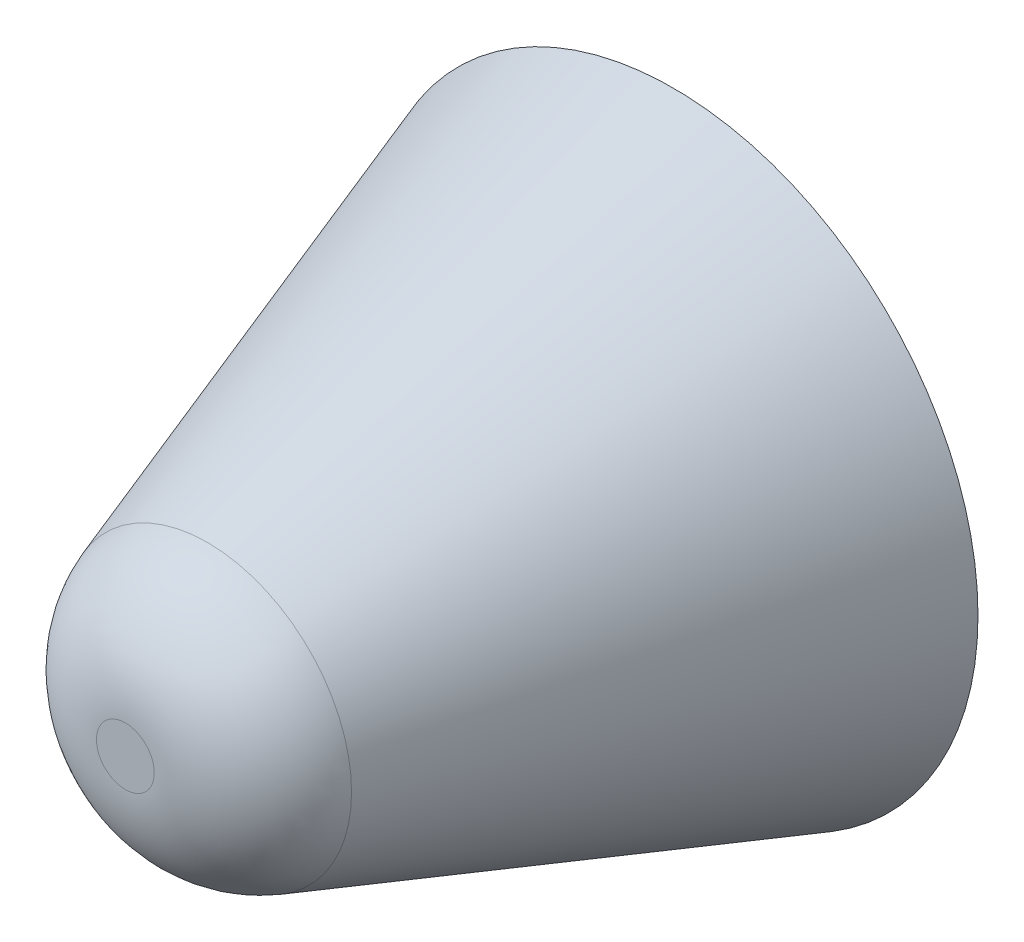
ISO-10303-21;
HEADER;
FILE_DESCRIPTION(('STEP AP214'),'2;1');
FILE_NAME('part.step','',(''),(''),'','','');
FILE_SCHEMA(('AUTOMOTIVE_DESIGN { 1 0 10303 214 1 1 1 1 }'));
ENDSEC;
DATA;
#1=APPLICATION_CONTEXT('core data for automotive mechanical design processes');
#2=APPLICATION_PROTOCOL_DEFINITION('international standard','automotive_design',2000,#1);
#3=PRODUCT_CONTEXT('',#1,'mechanical');
#4=PRODUCT('Part','Part','',(#3));
#5=PRODUCT_RELATED_PRODUCT_CATEGORY('part','',(#4));
#6=PRODUCT_DEFINITION_FORMATION('','',#4);
#7=PRODUCT_DEFINITION_CONTEXT('part definition',#1,'design');
#8=PRODUCT_DEFINITION('design','',#6,#7);
#9=PRODUCT_DEFINITION_SHAPE('','',#8);
#10=(LENGTH_UNIT() NAMED_UNIT(*) SI_UNIT(.MILLI.,.METRE.));
#11=(NAMED_UNIT(*) PLANE_ANGLE_UNIT() SI_UNIT($,.RADIAN.));
#12=(NAMED_UNIT(*) SI_UNIT($,.STERADIAN.) SOLID_ANGLE_UNIT());
#13=UNCERTAINTY_MEASURE_WITH_UNIT(LENGTH_MEASURE(1.E-05),#10,'distance_accuracy_value','');
#14=(GEOMETRIC_REPRESENTATION_CONTEXT(3) GLOBAL_UNCERTAINTY_ASSIGNED_CONTEXT((#13)) GLOBAL_UNIT_ASSIGNED_CONTEXT((#10,
#11,#12)) REPRESENTATION_CONTEXT('',''));
#15=CARTESIAN_POINT('',(0.,0.,0.));
#16=DIRECTION('',(0.,0.,1.));
#17=DIRECTION('',(1.,0.,0.));
#18=AXIS2_PLACEMENT_3D('',#15,#16,#17);
#19=CARTESIAN_POINT('',(0.,0.,0.));
#20=DIRECTION('',(0.,0.,-1.));
#21=DIRECTION('',(1.,0.,0.));
#22=AXIS2_PLACEMENT_3D('',#19,#20,#21);
#23=CONICAL_SURFACE('',#22,0.5,0.331612557878923);
#24=CARTESIAN_POINT('',(0.,0.,0.765113630891431));
#25=DIRECTION('',(0.,0.,-1.));
#26=DIRECTION('',(-1.,0.,0.));
#27=AXIS2_PLACEMENT_3D('',#24,#25,#26);
#28=CIRCLE('',#27,0.236550249579764);
#29=CARTESIAN_POINT('',(-0.236550249579764,0.,0.765113630891431));
#30=VERTEX_POINT('',#29);
#31=EDGE_CURVE('E10',#30,#30,#28,.T.);
#32=ORIENTED_EDGE('',*,*,#31,.T.);
#33=EDGE_LOOP('',(#32));
#34=FACE_BOUND('',#33,.T.);
#35=CARTESIAN_POINT('',(0.,0.,0.));
#36=DIRECTION('',(0.,0.,1.));
#37=DIRECTION('',(1.,0.,0.));
#38=AXIS2_PLACEMENT_3D('',#35,#36,#37);
#39=CIRCLE('',#38,0.5);
#40=CARTESIAN_POINT('',(0.5,0.,0.));
#41=VERTEX_POINT('',#40);
#42=EDGE_CURVE('E41',#41,#41,#39,.T.);
#43=ORIENTED_EDGE('',*,*,#42,.T.);
#44=EDGE_LOOP('',(#43));
#45=FACE_BOUND('',#44,.T.);
#46=ADVANCED_FACE('F30',(#34,#45),#23,.T.);
#47=CARTESIAN_POINT('',(0.,0.,0.9));
#48=DIRECTION('',(0.,0.,1.));
#49=DIRECTION('',(1.,0.,0.));
#50=AXIS2_PLACEMENT_3D('',#47,#48,#49);
#51=PLANE('',#50);
#52=CARTESIAN_POINT('',(0.,0.,0.9));
#53=DIRECTION('',(0.,0.,1.));
#54=DIRECTION('',(1.,0.,0.));
#55=AXIS2_PLACEMENT_3D('',#52,#53,#54);
#56=CIRCLE('',#55,0.0474465344599001);
#57=CARTESIAN_POINT('',(0.0474465344599001,0.,0.9));
#58=VERTEX_POINT('',#57);
#59=EDGE_CURVE('E37',#58,#58,#56,.T.);
#60=ORIENTED_EDGE('',*,*,#59,.T.);
#61=EDGE_LOOP('',(#60));
#62=FACE_BOUND('',#61,.T.);
#63=ADVANCED_FACE('F51',(#62),#51,.T.);
#64=CARTESIAN_POINT('',(0.,0.,0.));
#65=DIRECTION('',(0.,0.,1.));
#66=DIRECTION('',(1.,0.,0.));
#67=AXIS2_PLACEMENT_3D('',#64,#65,#66);
#68=PLANE('',#67);
#69=ORIENTED_EDGE('',*,*,#42,.F.);
#70=EDGE_LOOP('',(#69));
#71=FACE_BOUND('',#70,.T.);
#72=ADVANCED_FACE('F49',(#71),#68,.F.);
#73=CARTESIAN_POINT('',(0.,0.,0.7));
#74=DIRECTION('',(0.,0.,1.));
#75=DIRECTION('',(1.,0.,0.));
#76=AXIS2_PLACEMENT_3D('',#73,#74,#75);
#77=DEGENERATE_TOROIDAL_SURFACE('',#76,0.0474465344599001,0.2,.T.);
#78=ORIENTED_EDGE('',*,*,#31,.F.);
#79=EDGE_LOOP('',(#78));
#80=FACE_BOUND('',#79,.T.);
#81=ORIENTED_EDGE('',*,*,#59,.F.);
#82=EDGE_LOOP('',(#81));
#83=FACE_BOUND('',#82,.T.);
#84=ADVANCED_FACE('F32',(#80,#83),#77,.T.);
#85=CLOSED_SHELL('',(#46,#63,#72,#84));
#86=MANIFOLD_SOLID_BREP('B2',#85);
#87=ADVANCED_BREP_SHAPE_REPRESENTATION('',(#18,#86),#14);
#88=SHAPE_DEFINITION_REPRESENTATION(#9,#87);
ENDSEC;
END-ISO-10303-21;
